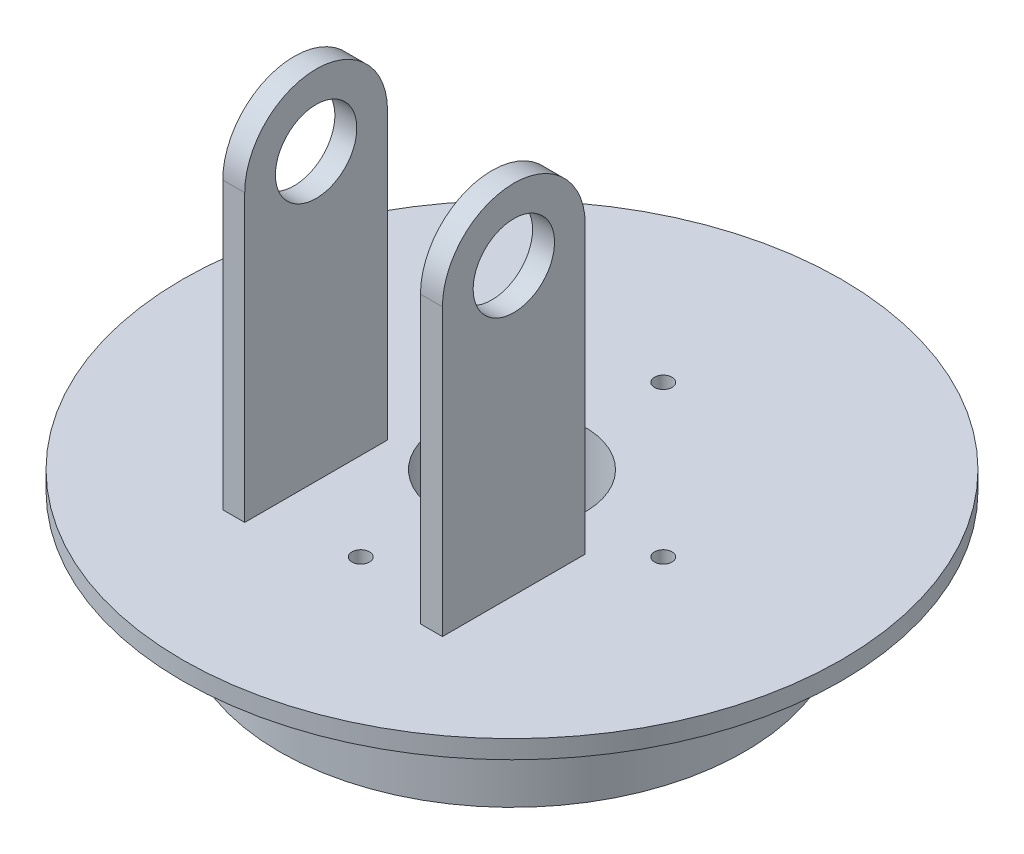
ISO-10303-21;
HEADER;
FILE_DESCRIPTION(('STEP AP214'),'2;1');
FILE_NAME('part.step','',(''),(''),'','','');
FILE_SCHEMA(('AUTOMOTIVE_DESIGN { 1 0 10303 214 1 1 1 1 }'));
ENDSEC;
DATA;
#1=APPLICATION_CONTEXT('core data for automotive mechanical design processes');
#2=APPLICATION_PROTOCOL_DEFINITION('international standard','automotive_design',2000,#1);
#3=PRODUCT_CONTEXT('',#1,'mechanical');
#4=PRODUCT('Part','Part','',(#3));
#5=PRODUCT_RELATED_PRODUCT_CATEGORY('part','',(#4));
#6=PRODUCT_DEFINITION_FORMATION('','',#4);
#7=PRODUCT_DEFINITION_CONTEXT('part definition',#1,'design');
#8=PRODUCT_DEFINITION('design','',#6,#7);
#9=PRODUCT_DEFINITION_SHAPE('','',#8);
#10=(LENGTH_UNIT() NAMED_UNIT(*) SI_UNIT(.MILLI.,.METRE.));
#11=(NAMED_UNIT(*) PLANE_ANGLE_UNIT() SI_UNIT($,.RADIAN.));
#12=(NAMED_UNIT(*) SI_UNIT($,.STERADIAN.) SOLID_ANGLE_UNIT());
#13=UNCERTAINTY_MEASURE_WITH_UNIT(LENGTH_MEASURE(1.E-05),#10,'distance_accuracy_value','');
#14=(GEOMETRIC_REPRESENTATION_CONTEXT(3) GLOBAL_UNCERTAINTY_ASSIGNED_CONTEXT((#13)) GLOBAL_UNIT_ASSIGNED_CONTEXT((#10,
#11,#12)) REPRESENTATION_CONTEXT('',''));
#15=CARTESIAN_POINT('',(0.,0.,0.));
#16=DIRECTION('',(0.,0.,1.));
#17=DIRECTION('',(1.,0.,0.));
#18=AXIS2_PLACEMENT_3D('',#15,#16,#17);
#19=CARTESIAN_POINT('',(0.,5.,0.));
#20=DIRECTION('',(0.,1.,0.));
#21=DIRECTION('',(0.,0.,1.));
#22=AXIS2_PLACEMENT_3D('',#19,#20,#21);
#23=PLANE('',#22);
#24=CARTESIAN_POINT('',(0.,5.,0.));
#25=DIRECTION('',(0.,1.,0.));
#26=DIRECTION('',(0.,0.,1.));
#27=AXIS2_PLACEMENT_3D('',#24,#25,#26);
#28=CIRCLE('',#27,20.);
#29=CARTESIAN_POINT('',(0.,5.,20.));
#30=VERTEX_POINT('',#29);
#31=EDGE_CURVE('E230',#30,#30,#28,.T.);
#32=ORIENTED_EDGE('',*,*,#31,.F.);
#33=EDGE_LOOP('',(#32));
#34=FACE_BOUND('',#33,.T.);
#35=DIRECTION('',(1.,0.,0.));
#36=VECTOR('',#35,1.);
#37=CARTESIAN_POINT('',(-30.,5.,49.));
#38=LINE('',#37,#36);
#39=CARTESIAN_POINT('',(-30.,5.,49.));
#40=VERTEX_POINT('',#39);
#41=CARTESIAN_POINT('',(-24.,5.,49.));
#42=VERTEX_POINT('',#41);
#43=EDGE_CURVE('E156',#40,#42,#38,.T.);
#44=ORIENTED_EDGE('',*,*,#43,.F.);
#45=DIRECTION('',(0.,0.,1.));
#46=VECTOR('',#45,1.);
#47=CARTESIAN_POINT('',(-30.,5.,10.));
#48=LINE('',#47,#46);
#49=CARTESIAN_POINT('',(-30.,5.,10.));
#50=VERTEX_POINT('',#49);
#51=EDGE_CURVE('E145',#50,#40,#48,.T.);
#52=ORIENTED_EDGE('',*,*,#51,.F.);
#53=DIRECTION('',(-1.,0.,0.));
#54=VECTOR('',#53,1.);
#55=CARTESIAN_POINT('',(-30.,5.,10.));
#56=LINE('',#55,#54);
#57=CARTESIAN_POINT('',(-24.,5.,10.));
#58=VERTEX_POINT('',#57);
#59=EDGE_CURVE('E150',#58,#50,#56,.T.);
#60=ORIENTED_EDGE('',*,*,#59,.F.);
#61=DIRECTION('',(0.,0.,-1.));
#62=VECTOR('',#61,1.);
#63=CARTESIAN_POINT('',(-24.,5.,10.));
#64=LINE('',#63,#62);
#65=EDGE_CURVE('E158',#42,#58,#64,.T.);
#66=ORIENTED_EDGE('',*,*,#65,.F.);
#67=EDGE_LOOP('',(#44,#52,#60,#66));
#68=FACE_BOUND('',#67,.T.);
#69=CARTESIAN_POINT('',(41.31,5.,0.));
#70=DIRECTION('',(0.,1.,0.));
#71=DIRECTION('',(0.,0.,-1.));
#72=AXIS2_PLACEMENT_3D('',#69,#70,#71);
#73=CIRCLE('',#72,2.415);
#74=CARTESIAN_POINT('',(41.31,5.,-2.41500000000006));
#75=VERTEX_POINT('',#74);
#76=EDGE_CURVE('E169',#75,#75,#73,.T.);
#77=ORIENTED_EDGE('',*,*,#76,.F.);
#78=EDGE_LOOP('',(#77));
#79=FACE_BOUND('',#78,.T.);
#80=CARTESIAN_POINT('',(-41.31,5.,0.));
#81=DIRECTION('',(0.,1.,0.));
#82=DIRECTION('',(0.,0.,1.));
#83=AXIS2_PLACEMENT_3D('',#80,#81,#82);
#84=CIRCLE('',#83,2.415);
#85=CARTESIAN_POINT('',(-41.31,5.,2.415));
#86=VERTEX_POINT('',#85);
#87=EDGE_CURVE('E173',#86,#86,#84,.T.);
#88=ORIENTED_EDGE('',*,*,#87,.F.);
#89=EDGE_LOOP('',(#88));
#90=FACE_BOUND('',#89,.T.);
#91=CARTESIAN_POINT('',(0.,5.,41.31));
#92=DIRECTION('',(0.,1.,0.));
#93=DIRECTION('',(0.,0.,-1.));
#94=AXIS2_PLACEMENT_3D('',#91,#92,#93);
#95=CIRCLE('',#94,2.415);
#96=CARTESIAN_POINT('',(0.,5.,38.895));
#97=VERTEX_POINT('',#96);
#98=EDGE_CURVE('E179',#97,#97,#95,.T.);
#99=ORIENTED_EDGE('',*,*,#98,.F.);
#100=EDGE_LOOP('',(#99));
#101=FACE_BOUND('',#100,.T.);
#102=CARTESIAN_POINT('',(0.,5.,-41.31));
#103=DIRECTION('',(0.,1.,0.));
#104=DIRECTION('',(0.,0.,1.));
#105=AXIS2_PLACEMENT_3D('',#102,#103,#104);
#106=CIRCLE('',#105,2.415);
#107=CARTESIAN_POINT('',(0.,5.,-38.895));
#108=VERTEX_POINT('',#107);
#109=EDGE_CURVE('E185',#108,#108,#106,.T.);
#110=ORIENTED_EDGE('',*,*,#109,.F.);
#111=EDGE_LOOP('',(#110));
#112=FACE_BOUND('',#111,.T.);
#113=CARTESIAN_POINT('',(0.,5.,0.));
#114=DIRECTION('',(0.,1.,0.));
#115=DIRECTION('',(0.,0.,1.));
#116=AXIS2_PLACEMENT_3D('',#113,#114,#115);
#117=CIRCLE('',#116,90.);
#118=CARTESIAN_POINT('',(0.,5.,90.));
#119=VERTEX_POINT('',#118);
#120=EDGE_CURVE('E41',#119,#119,#117,.T.);
#121=ORIENTED_EDGE('',*,*,#120,.T.);
#122=EDGE_LOOP('',(#121));
#123=FACE_BOUND('',#122,.T.);
#124=DIRECTION('',(-1.,0.,0.));
#125=VECTOR('',#124,1.);
#126=CARTESIAN_POINT('',(30.,5.,9.99999999999999));
#127=LINE('',#126,#125);
#128=CARTESIAN_POINT('',(30.,5.,9.99999999999999));
#129=VERTEX_POINT('',#128);
#130=CARTESIAN_POINT('',(24.,5.,9.99999999999999));
#131=VERTEX_POINT('',#130);
#132=EDGE_CURVE('E137',#129,#131,#127,.T.);
#133=ORIENTED_EDGE('',*,*,#132,.F.);
#134=DIRECTION('',(0.,0.,-1.));
#135=VECTOR('',#134,1.);
#136=CARTESIAN_POINT('',(30.,5.,9.99999999999999));
#137=LINE('',#136,#135);
#138=CARTESIAN_POINT('',(30.,5.,49.));
#139=VERTEX_POINT('',#138);
#140=EDGE_CURVE('E130',#139,#129,#137,.T.);
#141=ORIENTED_EDGE('',*,*,#140,.F.);
#142=DIRECTION('',(1.,0.,0.));
#143=VECTOR('',#142,1.);
#144=CARTESIAN_POINT('',(30.,5.,49.));
#145=LINE('',#144,#143);
#146=CARTESIAN_POINT('',(24.,5.,49.));
#147=VERTEX_POINT('',#146);
#148=EDGE_CURVE('E133',#147,#139,#145,.T.);
#149=ORIENTED_EDGE('',*,*,#148,.F.);
#150=DIRECTION('',(0.,0.,1.));
#151=VECTOR('',#150,1.);
#152=CARTESIAN_POINT('',(24.,5.,9.99999999999999));
#153=LINE('',#152,#151);
#154=EDGE_CURVE('E112',#131,#147,#153,.T.);
#155=ORIENTED_EDGE('',*,*,#154,.F.);
#156=EDGE_LOOP('',(#133,#141,#149,#155));
#157=FACE_BOUND('',#156,.T.);
#158=ADVANCED_FACE('F32',(#34,#68,#79,#90,#101,#112,#123,#157),#23,.T.);
#159=CARTESIAN_POINT('',(0.,0.,0.));
#160=DIRECTION('',(0.,1.,0.));
#161=DIRECTION('',(0.,0.,1.));
#162=AXIS2_PLACEMENT_3D('',#159,#160,#161);
#163=PLANE('',#162);
#164=CARTESIAN_POINT('',(0.,0.,0.));
#165=DIRECTION('',(0.,1.,0.));
#166=DIRECTION('',(0.,0.,1.));
#167=AXIS2_PLACEMENT_3D('',#164,#165,#166);
#168=CIRCLE('',#167,90.);
#169=CARTESIAN_POINT('',(0.,0.,90.));
#170=VERTEX_POINT('',#169);
#171=EDGE_CURVE('E196',#170,#170,#168,.T.);
#172=ORIENTED_EDGE('',*,*,#171,.F.);
#173=EDGE_LOOP('',(#172));
#174=FACE_BOUND('',#173,.T.);
#175=CARTESIAN_POINT('',(0.,0.,0.));
#176=DIRECTION('',(0.,1.,0.));
#177=DIRECTION('',(0.,0.,1.));
#178=AXIS2_PLACEMENT_3D('',#175,#176,#177);
#179=CIRCLE('',#178,63.5);
#180=CARTESIAN_POINT('',(0.,0.,63.5));
#181=VERTEX_POINT('',#180);
#182=EDGE_CURVE('E11',#181,#181,#179,.F.);
#183=ORIENTED_EDGE('',*,*,#182,.F.);
#184=EDGE_LOOP('',(#183));
#185=FACE_BOUND('',#184,.T.);
#186=ADVANCED_FACE('F203',(#174,#185),#163,.F.);
#187=CARTESIAN_POINT('',(0.,5.,0.));
#188=DIRECTION('',(0.,-1.,0.));
#189=DIRECTION('',(0.,0.,-1.));
#190=AXIS2_PLACEMENT_3D('',#187,#188,#189);
#191=CYLINDRICAL_SURFACE('',#190,90.);
#192=ORIENTED_EDGE('',*,*,#120,.F.);
#193=EDGE_LOOP('',(#192));
#194=FACE_BOUND('',#193,.T.);
#195=ORIENTED_EDGE('',*,*,#171,.T.);
#196=EDGE_LOOP('',(#195));
#197=FACE_BOUND('',#196,.T.);
#198=ADVANCED_FACE('F34',(#194,#197),#191,.T.);
#199=CARTESIAN_POINT('',(0.,-30.,0.));
#200=DIRECTION('',(0.,1.,0.));
#201=DIRECTION('',(0.,0.,1.));
#202=AXIS2_PLACEMENT_3D('',#199,#200,#201);
#203=CYLINDRICAL_SURFACE('',#202,63.5);
#204=CARTESIAN_POINT('',(0.,-30.,0.));
#205=DIRECTION('',(0.,-1.,0.));
#206=DIRECTION('',(0.,0.,-1.));
#207=AXIS2_PLACEMENT_3D('',#204,#205,#206);
#208=CIRCLE('',#207,63.5);
#209=CARTESIAN_POINT('',(0.,-30.,-63.5));
#210=VERTEX_POINT('',#209);
#211=EDGE_CURVE('E191',#210,#210,#208,.T.);
#212=ORIENTED_EDGE('',*,*,#211,.F.);
#213=EDGE_LOOP('',(#212));
#214=FACE_BOUND('',#213,.T.);
#215=ORIENTED_EDGE('',*,*,#182,.T.);
#216=EDGE_LOOP('',(#215));
#217=FACE_BOUND('',#216,.T.);
#218=ADVANCED_FACE('F208',(#214,#217),#203,.T.);
#219=CARTESIAN_POINT('',(0.,-30.,0.));
#220=DIRECTION('',(0.,-1.,0.));
#221=DIRECTION('',(0.,0.,-1.));
#222=AXIS2_PLACEMENT_3D('',#219,#220,#221);
#223=PLANE('',#222);
#224=CARTESIAN_POINT('',(0.,-30.,0.));
#225=DIRECTION('',(0.,1.,0.));
#226=DIRECTION('',(0.,0.,1.));
#227=AXIS2_PLACEMENT_3D('',#224,#225,#226);
#228=CIRCLE('',#227,20.);
#229=CARTESIAN_POINT('',(0.,-30.,20.));
#230=VERTEX_POINT('',#229);
#231=EDGE_CURVE('E451',#230,#230,#228,.T.);
#232=ORIENTED_EDGE('',*,*,#231,.T.);
#233=EDGE_LOOP('',(#232));
#234=FACE_BOUND('',#233,.T.);
#235=CARTESIAN_POINT('',(41.31,-30.,0.));
#236=DIRECTION('',(0.,1.,0.));
#237=DIRECTION('',(0.,0.,-1.));
#238=AXIS2_PLACEMENT_3D('',#235,#236,#237);
#239=CIRCLE('',#238,2.415);
#240=CARTESIAN_POINT('',(41.31,-30.,-2.41500000000006));
#241=VERTEX_POINT('',#240);
#242=EDGE_CURVE('E170',#241,#241,#239,.T.);
#243=ORIENTED_EDGE('',*,*,#242,.T.);
#244=EDGE_LOOP('',(#243));
#245=FACE_BOUND('',#244,.T.);
#246=CARTESIAN_POINT('',(-41.31,-30.,0.));
#247=DIRECTION('',(0.,1.,0.));
#248=DIRECTION('',(0.,0.,1.));
#249=AXIS2_PLACEMENT_3D('',#246,#247,#248);
#250=CIRCLE('',#249,2.415);
#251=CARTESIAN_POINT('',(-41.31,-30.,2.415));
#252=VERTEX_POINT('',#251);
#253=EDGE_CURVE('E176',#252,#252,#250,.T.);
#254=ORIENTED_EDGE('',*,*,#253,.T.);
#255=EDGE_LOOP('',(#254));
#256=FACE_BOUND('',#255,.T.);
#257=CARTESIAN_POINT('',(0.,-30.,41.31));
#258=DIRECTION('',(0.,1.,0.));
#259=DIRECTION('',(0.,0.,-1.));
#260=AXIS2_PLACEMENT_3D('',#257,#258,#259);
#261=CIRCLE('',#260,2.415);
#262=CARTESIAN_POINT('',(0.,-30.,38.895));
#263=VERTEX_POINT('',#262);
#264=EDGE_CURVE('E182',#263,#263,#261,.T.);
#265=ORIENTED_EDGE('',*,*,#264,.T.);
#266=EDGE_LOOP('',(#265));
#267=FACE_BOUND('',#266,.T.);
#268=CARTESIAN_POINT('',(0.,-30.,-41.31));
#269=DIRECTION('',(0.,1.,0.));
#270=DIRECTION('',(0.,0.,1.));
#271=AXIS2_PLACEMENT_3D('',#268,#269,#270);
#272=CIRCLE('',#271,2.415);
#273=CARTESIAN_POINT('',(0.,-30.,-38.895));
#274=VERTEX_POINT('',#273);
#275=EDGE_CURVE('E188',#274,#274,#272,.T.);
#276=ORIENTED_EDGE('',*,*,#275,.T.);
#277=EDGE_LOOP('',(#276));
#278=FACE_BOUND('',#277,.T.);
#279=ORIENTED_EDGE('',*,*,#211,.T.);
#280=EDGE_LOOP('',(#279));
#281=FACE_BOUND('',#280,.T.);
#282=ADVANCED_FACE('F210',(#234,#245,#256,#267,#278,#281),#223,.T.);
#283=CARTESIAN_POINT('',(0.,-30.,-41.31));
#284=DIRECTION('',(0.,1.,0.));
#285=DIRECTION('',(0.,0.,1.));
#286=AXIS2_PLACEMENT_3D('',#283,#284,#285);
#287=CYLINDRICAL_SURFACE('',#286,2.415);
#288=ORIENTED_EDGE('',*,*,#275,.F.);
#289=EDGE_LOOP('',(#288));
#290=FACE_BOUND('',#289,.T.);
#291=ORIENTED_EDGE('',*,*,#109,.T.);
#292=EDGE_LOOP('',(#291));
#293=FACE_BOUND('',#292,.T.);
#294=ADVANCED_FACE('F217',(#290,#293),#287,.F.);
#295=CARTESIAN_POINT('',(0.,-30.,41.31));
#296=DIRECTION('',(0.,1.,0.));
#297=DIRECTION('',(0.,0.,1.));
#298=AXIS2_PLACEMENT_3D('',#295,#296,#297);
#299=CYLINDRICAL_SURFACE('',#298,2.415);
#300=ORIENTED_EDGE('',*,*,#264,.F.);
#301=EDGE_LOOP('',(#300));
#302=FACE_BOUND('',#301,.T.);
#303=ORIENTED_EDGE('',*,*,#98,.T.);
#304=EDGE_LOOP('',(#303));
#305=FACE_BOUND('',#304,.T.);
#306=ADVANCED_FACE('F284',(#302,#305),#299,.F.);
#307=CARTESIAN_POINT('',(-41.31,-30.,0.));
#308=DIRECTION('',(0.,1.,0.));
#309=DIRECTION('',(0.,0.,1.));
#310=AXIS2_PLACEMENT_3D('',#307,#308,#309);
#311=CYLINDRICAL_SURFACE('',#310,2.415);
#312=ORIENTED_EDGE('',*,*,#253,.F.);
#313=EDGE_LOOP('',(#312));
#314=FACE_BOUND('',#313,.T.);
#315=ORIENTED_EDGE('',*,*,#87,.T.);
#316=EDGE_LOOP('',(#315));
#317=FACE_BOUND('',#316,.T.);
#318=ADVANCED_FACE('F280',(#314,#317),#311,.F.);
#319=CARTESIAN_POINT('',(41.31,-30.,0.));
#320=DIRECTION('',(0.,1.,0.));
#321=DIRECTION('',(0.,0.,1.));
#322=AXIS2_PLACEMENT_3D('',#319,#320,#321);
#323=CYLINDRICAL_SURFACE('',#322,2.415);
#324=ORIENTED_EDGE('',*,*,#242,.F.);
#325=EDGE_LOOP('',(#324));
#326=FACE_BOUND('',#325,.T.);
#327=ORIENTED_EDGE('',*,*,#76,.T.);
#328=EDGE_LOOP('',(#327));
#329=FACE_BOUND('',#328,.T.);
#330=ADVANCED_FACE('F276',(#326,#329),#323,.F.);
#331=CARTESIAN_POINT('',(-30.,83.,10.));
#332=DIRECTION('',(1.,0.,0.));
#333=DIRECTION('',(0.,0.,-1.));
#334=AXIS2_PLACEMENT_3D('',#331,#332,#333);
#335=PLANE('',#334);
#336=CARTESIAN_POINT('',(-30.,83.,29.5));
#337=DIRECTION('',(-1.,0.,0.));
#338=DIRECTION('',(0.,0.,1.));
#339=AXIS2_PLACEMENT_3D('',#336,#337,#338);
#340=CIRCLE('',#339,11.1125);
#341=CARTESIAN_POINT('',(-30.,83.,40.6125));
#342=VERTEX_POINT('',#341);
#343=EDGE_CURVE('E448',#342,#342,#340,.T.);
#344=ORIENTED_EDGE('',*,*,#343,.F.);
#345=EDGE_LOOP('',(#344));
#346=FACE_BOUND('',#345,.T.);
#347=ORIENTED_EDGE('',*,*,#51,.T.);
#348=DIRECTION('',(0.,-1.,0.));
#349=VECTOR('',#348,1.);
#350=CARTESIAN_POINT('',(-30.,83.,49.));
#351=LINE('',#350,#349);
#352=CARTESIAN_POINT('',(-30.,83.,49.));
#353=VERTEX_POINT('',#352);
#354=EDGE_CURVE('E167',#353,#40,#351,.T.);
#355=ORIENTED_EDGE('',*,*,#354,.F.);
#356=CARTESIAN_POINT('',(-30.,83.,29.5));
#357=DIRECTION('',(-1.,0.,0.));
#358=DIRECTION('',(0.,0.,1.));
#359=AXIS2_PLACEMENT_3D('',#356,#357,#358);
#360=CIRCLE('',#359,19.5);
#361=CARTESIAN_POINT('',(-30.,83.,10.));
#362=VERTEX_POINT('',#361);
#363=EDGE_CURVE('E121',#353,#362,#360,.T.);
#364=ORIENTED_EDGE('',*,*,#363,.T.);
#365=DIRECTION('',(0.,-1.,0.));
#366=VECTOR('',#365,1.);
#367=CARTESIAN_POINT('',(-30.,83.,10.));
#368=LINE('',#367,#366);
#369=EDGE_CURVE('E153',#362,#50,#368,.T.);
#370=ORIENTED_EDGE('',*,*,#369,.T.);
#371=EDGE_LOOP('',(#347,#355,#364,#370));
#372=FACE_BOUND('',#371,.T.);
#373=ADVANCED_FACE('F272',(#346,#372),#335,.F.);
#374=CARTESIAN_POINT('',(-30.,83.,49.));
#375=DIRECTION('',(0.,0.,-1.));
#376=DIRECTION('',(-1.,0.,0.));
#377=AXIS2_PLACEMENT_3D('',#374,#375,#376);
#378=PLANE('',#377);
#379=ORIENTED_EDGE('',*,*,#43,.T.);
#380=DIRECTION('',(0.,-1.,0.));
#381=VECTOR('',#380,1.);
#382=CARTESIAN_POINT('',(-24.,83.,49.));
#383=LINE('',#382,#381);
#384=CARTESIAN_POINT('',(-24.,83.,49.));
#385=VERTEX_POINT('',#384);
#386=EDGE_CURVE('E164',#385,#42,#383,.T.);
#387=ORIENTED_EDGE('',*,*,#386,.F.);
#388=DIRECTION('',(1.,0.,0.));
#389=VECTOR('',#388,1.);
#390=CARTESIAN_POINT('',(-30.,83.,49.));
#391=LINE('',#390,#389);
#392=EDGE_CURVE('E146',#353,#385,#391,.T.);
#393=ORIENTED_EDGE('',*,*,#392,.F.);
#394=ORIENTED_EDGE('',*,*,#354,.T.);
#395=EDGE_LOOP('',(#379,#387,#393,#394));
#396=FACE_BOUND('',#395,.T.);
#397=ADVANCED_FACE('F268',(#396),#378,.F.);
#398=CARTESIAN_POINT('',(-24.,83.,10.));
#399=DIRECTION('',(-1.,0.,0.));
#400=DIRECTION('',(0.,0.,1.));
#401=AXIS2_PLACEMENT_3D('',#398,#399,#400);
#402=PLANE('',#401);
#403=CARTESIAN_POINT('',(-24.,83.,29.5));
#404=DIRECTION('',(-1.,0.,0.));
#405=DIRECTION('',(0.,0.,1.));
#406=AXIS2_PLACEMENT_3D('',#403,#404,#405);
#407=CIRCLE('',#406,11.1125);
#408=CARTESIAN_POINT('',(-24.,83.,40.6125));
#409=VERTEX_POINT('',#408);
#410=EDGE_CURVE('E119',#409,#409,#407,.T.);
#411=ORIENTED_EDGE('',*,*,#410,.T.);
#412=EDGE_LOOP('',(#411));
#413=FACE_BOUND('',#412,.T.);
#414=ORIENTED_EDGE('',*,*,#65,.T.);
#415=DIRECTION('',(0.,-1.,0.));
#416=VECTOR('',#415,1.);
#417=CARTESIAN_POINT('',(-24.,83.,10.));
#418=LINE('',#417,#416);
#419=CARTESIAN_POINT('',(-24.,83.,10.));
#420=VERTEX_POINT('',#419);
#421=EDGE_CURVE('E56',#420,#58,#418,.T.);
#422=ORIENTED_EDGE('',*,*,#421,.F.);
#423=CARTESIAN_POINT('',(-24.,83.,29.5));
#424=DIRECTION('',(-1.,0.,0.));
#425=DIRECTION('',(0.,0.,1.));
#426=AXIS2_PLACEMENT_3D('',#423,#424,#425);
#427=CIRCLE('',#426,19.5);
#428=EDGE_CURVE('E127',#385,#420,#427,.T.);
#429=ORIENTED_EDGE('',*,*,#428,.F.);
#430=ORIENTED_EDGE('',*,*,#386,.T.);
#431=EDGE_LOOP('',(#414,#422,#429,#430));
#432=FACE_BOUND('',#431,.T.);
#433=ADVANCED_FACE('F261',(#413,#432),#402,.F.);
#434=CARTESIAN_POINT('',(-30.,83.,10.));
#435=DIRECTION('',(0.,0.,1.));
#436=DIRECTION('',(1.,0.,0.));
#437=AXIS2_PLACEMENT_3D('',#434,#435,#436);
#438=PLANE('',#437);
#439=ORIENTED_EDGE('',*,*,#59,.T.);
#440=ORIENTED_EDGE('',*,*,#369,.F.);
#441=DIRECTION('',(-1.,0.,0.));
#442=VECTOR('',#441,1.);
#443=CARTESIAN_POINT('',(-30.,83.,10.));
#444=LINE('',#443,#442);
#445=EDGE_CURVE('E149',#420,#362,#444,.T.);
#446=ORIENTED_EDGE('',*,*,#445,.F.);
#447=ORIENTED_EDGE('',*,*,#421,.T.);
#448=EDGE_LOOP('',(#439,#440,#446,#447));
#449=FACE_BOUND('',#448,.T.);
#450=ADVANCED_FACE('F253',(#449),#438,.F.);
#451=CARTESIAN_POINT('',(30.,83.,9.99999999999999));
#452=DIRECTION('',(-1.,0.,0.));
#453=DIRECTION('',(0.,0.,1.));
#454=AXIS2_PLACEMENT_3D('',#451,#452,#453);
#455=PLANE('',#454);
#456=CARTESIAN_POINT('',(30.,83.,29.5));
#457=DIRECTION('',(-1.,0.,0.));
#458=DIRECTION('',(0.,0.,1.));
#459=AXIS2_PLACEMENT_3D('',#456,#457,#458);
#460=CIRCLE('',#459,11.1125);
#461=CARTESIAN_POINT('',(30.,83.,40.6125));
#462=VERTEX_POINT('',#461);
#463=EDGE_CURVE('E124',#462,#462,#460,.T.);
#464=ORIENTED_EDGE('',*,*,#463,.T.);
#465=EDGE_LOOP('',(#464));
#466=FACE_BOUND('',#465,.T.);
#467=ORIENTED_EDGE('',*,*,#140,.T.);
#468=DIRECTION('',(0.,-1.,0.));
#469=VECTOR('',#468,1.);
#470=CARTESIAN_POINT('',(30.,83.,9.99999999999999));
#471=LINE('',#470,#469);
#472=CARTESIAN_POINT('',(30.,83.,9.99999999999999));
#473=VERTEX_POINT('',#472);
#474=EDGE_CURVE('E143',#473,#129,#471,.T.);
#475=ORIENTED_EDGE('',*,*,#474,.F.);
#476=CARTESIAN_POINT('',(30.,83.,29.5));
#477=DIRECTION('',(-1.,0.,0.));
#478=DIRECTION('',(0.,0.,1.));
#479=AXIS2_PLACEMENT_3D('',#476,#477,#478);
#480=CIRCLE('',#479,19.5);
#481=CARTESIAN_POINT('',(30.,83.,49.));
#482=VERTEX_POINT('',#481);
#483=EDGE_CURVE('E118',#482,#473,#480,.T.);
#484=ORIENTED_EDGE('',*,*,#483,.F.);
#485=DIRECTION('',(0.,-1.,0.));
#486=VECTOR('',#485,1.);
#487=CARTESIAN_POINT('',(30.,83.,49.));
#488=LINE('',#487,#486);
#489=EDGE_CURVE('E99',#482,#139,#488,.T.);
#490=ORIENTED_EDGE('',*,*,#489,.T.);
#491=EDGE_LOOP('',(#467,#475,#484,#490));
#492=FACE_BOUND('',#491,.T.);
#493=ADVANCED_FACE('F251',(#466,#492),#455,.F.);
#494=CARTESIAN_POINT('',(30.,83.,9.99999999999999));
#495=DIRECTION('',(0.,0.,1.));
#496=DIRECTION('',(1.,0.,0.));
#497=AXIS2_PLACEMENT_3D('',#494,#495,#496);
#498=PLANE('',#497);
#499=ORIENTED_EDGE('',*,*,#132,.T.);
#500=DIRECTION('',(0.,-1.,0.));
#501=VECTOR('',#500,1.);
#502=CARTESIAN_POINT('',(24.,83.,9.99999999999999));
#503=LINE('',#502,#501);
#504=CARTESIAN_POINT('',(24.,83.,9.99999999999999));
#505=VERTEX_POINT('',#504);
#506=EDGE_CURVE('E114',#505,#131,#503,.T.);
#507=ORIENTED_EDGE('',*,*,#506,.F.);
#508=DIRECTION('',(-1.,0.,0.));
#509=VECTOR('',#508,1.);
#510=CARTESIAN_POINT('',(30.,83.,9.99999999999999));
#511=LINE('',#510,#509);
#512=EDGE_CURVE('E104',#473,#505,#511,.T.);
#513=ORIENTED_EDGE('',*,*,#512,.F.);
#514=ORIENTED_EDGE('',*,*,#474,.T.);
#515=EDGE_LOOP('',(#499,#507,#513,#514));
#516=FACE_BOUND('',#515,.T.);
#517=ADVANCED_FACE('F248',(#516),#498,.F.);
#518=CARTESIAN_POINT('',(24.,83.,9.99999999999999));
#519=DIRECTION('',(1.,0.,0.));
#520=DIRECTION('',(0.,0.,-1.));
#521=AXIS2_PLACEMENT_3D('',#518,#519,#520);
#522=PLANE('',#521);
#523=CARTESIAN_POINT('',(24.,83.,29.5));
#524=DIRECTION('',(1.,0.,0.));
#525=DIRECTION('',(0.,0.,-1.));
#526=AXIS2_PLACEMENT_3D('',#523,#524,#525);
#527=CIRCLE('',#526,11.1125);
#528=CARTESIAN_POINT('',(24.,83.,18.3875));
#529=VERTEX_POINT('',#528);
#530=EDGE_CURVE('E36',#529,#529,#527,.T.);
#531=ORIENTED_EDGE('',*,*,#530,.T.);
#532=EDGE_LOOP('',(#531));
#533=FACE_BOUND('',#532,.T.);
#534=ORIENTED_EDGE('',*,*,#154,.T.);
#535=DIRECTION('',(0.,-1.,0.));
#536=VECTOR('',#535,1.);
#537=CARTESIAN_POINT('',(24.,83.,49.));
#538=LINE('',#537,#536);
#539=CARTESIAN_POINT('',(24.,83.,49.));
#540=VERTEX_POINT('',#539);
#541=EDGE_CURVE('E48',#540,#147,#538,.T.);
#542=ORIENTED_EDGE('',*,*,#541,.F.);
#543=CARTESIAN_POINT('',(24.,83.,29.5));
#544=DIRECTION('',(-1.,0.,0.));
#545=DIRECTION('',(0.,0.,1.));
#546=AXIS2_PLACEMENT_3D('',#543,#544,#545);
#547=CIRCLE('',#546,19.5);
#548=EDGE_CURVE('E110',#540,#505,#547,.T.);
#549=ORIENTED_EDGE('',*,*,#548,.T.);
#550=ORIENTED_EDGE('',*,*,#506,.T.);
#551=EDGE_LOOP('',(#534,#542,#549,#550));
#552=FACE_BOUND('',#551,.T.);
#553=ADVANCED_FACE('F108',(#533,#552),#522,.F.);
#554=CARTESIAN_POINT('',(30.,83.,49.));
#555=DIRECTION('',(0.,0.,-1.));
#556=DIRECTION('',(-1.,0.,0.));
#557=AXIS2_PLACEMENT_3D('',#554,#555,#556);
#558=PLANE('',#557);
#559=ORIENTED_EDGE('',*,*,#148,.T.);
#560=ORIENTED_EDGE('',*,*,#489,.F.);
#561=DIRECTION('',(1.,0.,0.));
#562=VECTOR('',#561,1.);
#563=CARTESIAN_POINT('',(30.,83.,49.));
#564=LINE('',#563,#562);
#565=EDGE_CURVE('E96',#540,#482,#564,.T.);
#566=ORIENTED_EDGE('',*,*,#565,.F.);
#567=ORIENTED_EDGE('',*,*,#541,.T.);
#568=EDGE_LOOP('',(#559,#560,#566,#567));
#569=FACE_BOUND('',#568,.T.);
#570=ADVANCED_FACE('F97',(#569),#558,.F.);
#571=CARTESIAN_POINT('',(-24.,83.,29.5));
#572=DIRECTION('',(-1.,0.,0.));
#573=DIRECTION('',(0.,0.,1.));
#574=AXIS2_PLACEMENT_3D('',#571,#572,#573);
#575=CYLINDRICAL_SURFACE('',#574,19.5);
#576=ORIENTED_EDGE('',*,*,#363,.F.);
#577=ORIENTED_EDGE('',*,*,#392,.T.);
#578=ORIENTED_EDGE('',*,*,#428,.T.);
#579=ORIENTED_EDGE('',*,*,#445,.T.);
#580=EDGE_LOOP('',(#576,#577,#578,#579));
#581=FACE_BOUND('',#580,.T.);
#582=ADVANCED_FACE('F335',(#581),#575,.T.);
#583=CARTESIAN_POINT('',(30.,83.,29.5));
#584=DIRECTION('',(-1.,0.,0.));
#585=DIRECTION('',(0.,0.,1.));
#586=AXIS2_PLACEMENT_3D('',#583,#584,#585);
#587=CYLINDRICAL_SURFACE('',#586,19.5);
#588=ORIENTED_EDGE('',*,*,#548,.F.);
#589=ORIENTED_EDGE('',*,*,#565,.T.);
#590=ORIENTED_EDGE('',*,*,#483,.T.);
#591=ORIENTED_EDGE('',*,*,#512,.T.);
#592=EDGE_LOOP('',(#588,#589,#590,#591));
#593=FACE_BOUND('',#592,.T.);
#594=ADVANCED_FACE('F117',(#593),#587,.T.);
#595=CARTESIAN_POINT('',(90.,83.,29.5));
#596=DIRECTION('',(-1.,0.,0.));
#597=DIRECTION('',(0.,0.,1.));
#598=AXIS2_PLACEMENT_3D('',#595,#596,#597);
#599=CYLINDRICAL_SURFACE('',#598,11.1125);
#600=ORIENTED_EDGE('',*,*,#530,.F.);
#601=EDGE_LOOP('',(#600));
#602=FACE_BOUND('',#601,.T.);
#603=ORIENTED_EDGE('',*,*,#463,.F.);
#604=EDGE_LOOP('',(#603));
#605=FACE_BOUND('',#604,.T.);
#606=ADVANCED_FACE('F364',(#602,#605),#599,.F.);
#607=ORIENTED_EDGE('',*,*,#343,.T.);
#608=EDGE_LOOP('',(#607));
#609=FACE_BOUND('',#608,.T.);
#610=ORIENTED_EDGE('',*,*,#410,.F.);
#611=EDGE_LOOP('',(#610));
#612=FACE_BOUND('',#611,.T.);
#613=ADVANCED_FACE('F375',(#609,#612),#599,.F.);
#614=CARTESIAN_POINT('',(0.,-30.,0.));
#615=DIRECTION('',(0.,1.,0.));
#616=DIRECTION('',(0.,0.,1.));
#617=AXIS2_PLACEMENT_3D('',#614,#615,#616);
#618=CYLINDRICAL_SURFACE('',#617,20.);
#619=ORIENTED_EDGE('',*,*,#231,.F.);
#620=EDGE_LOOP('',(#619));
#621=FACE_BOUND('',#620,.T.);
#622=ORIENTED_EDGE('',*,*,#31,.T.);
#623=EDGE_LOOP('',(#622));
#624=FACE_BOUND('',#623,.T.);
#625=ADVANCED_FACE('F383',(#621,#624),#618,.F.);
#626=CLOSED_SHELL('',(#158,#186,#198,#218,#282,#294,#306,#318,#330,#373,#397,#433,#450,#493,
#517,#553,#570,#582,#594,#606,#613,#625));
#627=MANIFOLD_SOLID_BREP('B2',#626);
#628=ADVANCED_BREP_SHAPE_REPRESENTATION('',(#18,#627),#14);
#629=SHAPE_DEFINITION_REPRESENTATION(#9,#628);
ENDSEC;
END-ISO-10303-21;
